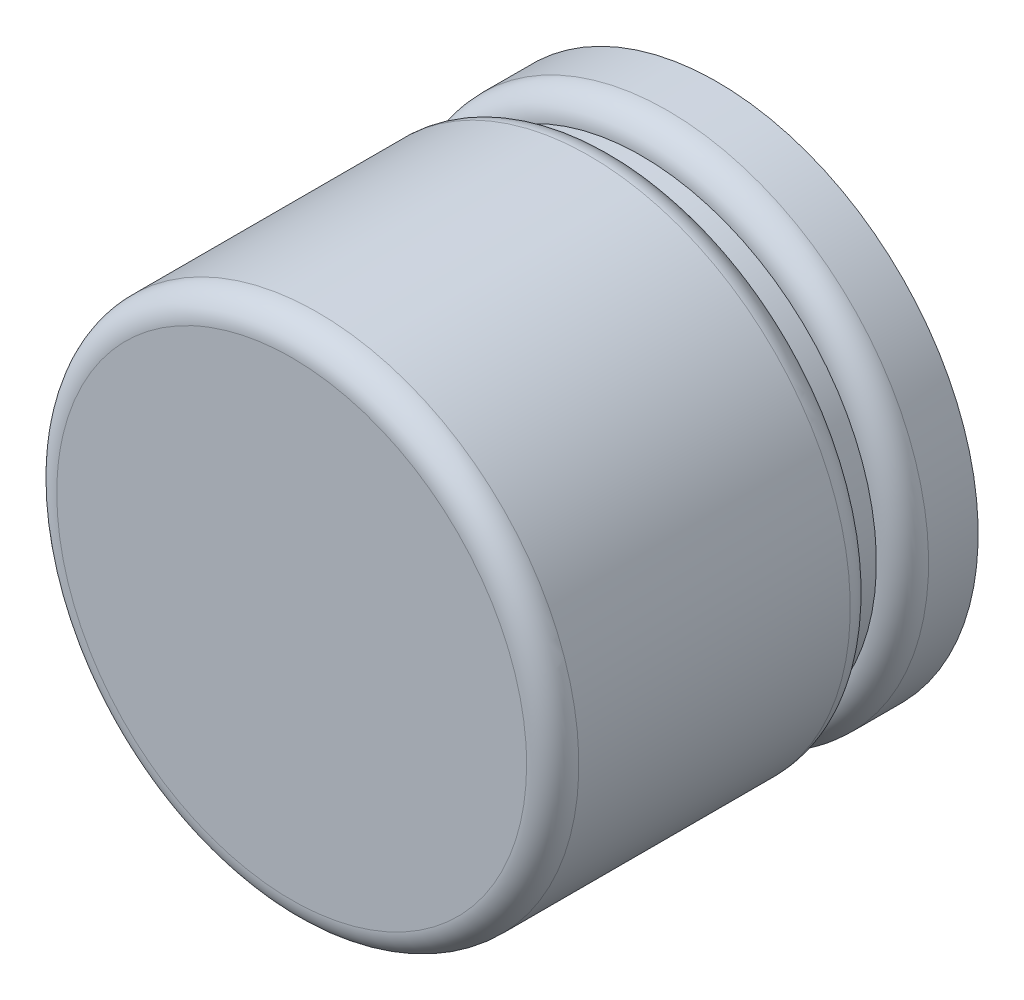
ISO-10303-21;
HEADER;
FILE_DESCRIPTION(('STEP AP214'),'2;1');
FILE_NAME('part.step','',(''),(''),'','','');
FILE_SCHEMA(('AUTOMOTIVE_DESIGN { 1 0 10303 214 1 1 1 1 }'));
ENDSEC;
DATA;
#1=APPLICATION_CONTEXT('core data for automotive mechanical design processes');
#2=APPLICATION_PROTOCOL_DEFINITION('international standard','automotive_design',2000,#1);
#3=PRODUCT_CONTEXT('',#1,'mechanical');
#4=PRODUCT('Part','Part','',(#3));
#5=PRODUCT_RELATED_PRODUCT_CATEGORY('part','',(#4));
#6=PRODUCT_DEFINITION_FORMATION('','',#4);
#7=PRODUCT_DEFINITION_CONTEXT('part definition',#1,'design');
#8=PRODUCT_DEFINITION('design','',#6,#7);
#9=PRODUCT_DEFINITION_SHAPE('','',#8);
#10=(LENGTH_UNIT() NAMED_UNIT(*) SI_UNIT(.MILLI.,.METRE.));
#11=(NAMED_UNIT(*) PLANE_ANGLE_UNIT() SI_UNIT($,.RADIAN.));
#12=(NAMED_UNIT(*) SI_UNIT($,.STERADIAN.) SOLID_ANGLE_UNIT());
#13=UNCERTAINTY_MEASURE_WITH_UNIT(LENGTH_MEASURE(1.E-05),#10,'distance_accuracy_value','');
#14=(GEOMETRIC_REPRESENTATION_CONTEXT(3) GLOBAL_UNCERTAINTY_ASSIGNED_CONTEXT((#13)) GLOBAL_UNIT_ASSIGNED_CONTEXT((#10,
#11,#12)) REPRESENTATION_CONTEXT('',''));
#15=CARTESIAN_POINT('',(0.,0.,0.));
#16=DIRECTION('',(0.,0.,1.));
#17=DIRECTION('',(1.,0.,0.));
#18=AXIS2_PLACEMENT_3D('',#15,#16,#17);
#19=CARTESIAN_POINT('',(-5.99999746,-5.99999746,0.639999985695));
#20=DIRECTION('',(0.,0.,1.));
#21=DIRECTION('',(1.,0.,0.));
#22=AXIS2_PLACEMENT_3D('',#19,#20,#21);
#23=PLANE('',#22);
#24=CARTESIAN_POINT('',(2.54000000055E-06,-1.84279794,0.639999985695));
#25=DIRECTION('',(0.,0.,-1.));
#26=DIRECTION('',(-1.,0.,0.));
#27=AXIS2_PLACEMENT_3D('',#24,#25,#26);
#28=CIRCLE('',#27,2.000000000188);
#29=CARTESIAN_POINT('',(-1.999997460188,-1.84279794,0.639999985695));
#30=VERTEX_POINT('',#29);
#31=EDGE_CURVE('E21',#30,#30,#28,.F.);
#32=ORIENTED_EDGE('',*,*,#31,.F.);
#33=EDGE_LOOP('',(#32));
#34=FACE_BOUND('',#33,.T.);
#35=ADVANCED_FACE('F16',(#34),#23,.F.);
#36=CARTESIAN_POINT('',(2.54000000055E-06,-1.84279794,1.01999996));
#37=DIRECTION('',(0.,0.,-1.));
#38=DIRECTION('',(-1.,0.,0.));
#39=AXIS2_PLACEMENT_3D('',#36,#37,#38);
#40=CYLINDRICAL_SURFACE('',#39,2.000000000188);
#41=ORIENTED_EDGE('',*,*,#31,.T.);
#42=EDGE_LOOP('',(#41));
#43=FACE_BOUND('',#42,.T.);
#44=CARTESIAN_POINT('',(2.54000000004216E-06,-1.84279794,1.01999996));
#45=DIRECTION('',(0.,0.,-1.));
#46=DIRECTION('',(0.,1.,0.));
#47=AXIS2_PLACEMENT_3D('',#44,#45,#46);
#48=CIRCLE('',#47,1.99999999965255);
#49=CARTESIAN_POINT('',(2.54000000004216E-06,0.157202059652549,1.01999996));
#50=VERTEX_POINT('',#49);
#51=EDGE_CURVE('E42',#50,#50,#48,.F.);
#52=ORIENTED_EDGE('',*,*,#51,.F.);
#53=EDGE_LOOP('',(#52));
#54=FACE_BOUND('',#53,.T.);
#55=ADVANCED_FACE('F62',(#43,#54),#40,.T.);
#56=CARTESIAN_POINT('',(2.54000000004216E-06,-1.84279794,1.01999996));
#57=DIRECTION('',(0.,0.,-1.));
#58=DIRECTION('',(0.,1.,0.));
#59=AXIS2_PLACEMENT_3D('',#56,#57,#58);
#60=TOROIDAL_SURFACE('',#59,1.79999999965258,0.199999999999965);
#61=ORIENTED_EDGE('',*,*,#51,.T.);
#62=EDGE_LOOP('',(#61));
#63=FACE_BOUND('',#62,.T.);
#64=CARTESIAN_POINT('',(2.54000000055E-06,-1.84279794,1.21999996));
#65=DIRECTION('',(0.,0.,-1.));
#66=DIRECTION('',(-1.,0.,0.));
#67=AXIS2_PLACEMENT_3D('',#64,#65,#66);
#68=CIRCLE('',#67,1.799999999653);
#69=CARTESIAN_POINT('',(-1.799997459653,-1.84279794,1.21999996));
#70=VERTEX_POINT('',#69);
#71=EDGE_CURVE('E40',#70,#70,#68,.F.);
#72=ORIENTED_EDGE('',*,*,#71,.F.);
#73=EDGE_LOOP('',(#72));
#74=FACE_BOUND('',#73,.T.);
#75=ADVANCED_FACE('F58',(#63,#74),#60,.T.);
#76=CARTESIAN_POINT('',(-2.42999768,0.6200013,3.89999982));
#77=DIRECTION('',(0.,0.,-1.));
#78=DIRECTION('',(-1.,0.,0.));
#79=AXIS2_PLACEMENT_3D('',#76,#77,#78);
#80=PLANE('',#79);
#81=CARTESIAN_POINT('',(2.54000000047584E-06,-1.84279794,3.89999982));
#82=DIRECTION('',(0.,0.,1.));
#83=DIRECTION('',(0.,-1.,0.));
#84=AXIS2_PLACEMENT_3D('',#81,#82,#83);
#85=CIRCLE('',#84,1.800000000188);
#86=CARTESIAN_POINT('',(1.800002540188,-1.84279794000053,3.89999982));
#87=VERTEX_POINT('',#86);
#88=CARTESIAN_POINT('',(-1.799997460188,-1.84279794,3.89999982));
#89=VERTEX_POINT('',#88);
#90=EDGE_CURVE('E33',#87,#89,#85,.F.);
#91=ORIENTED_EDGE('',*,*,#90,.F.);
#92=CARTESIAN_POINT('',(-1.799997460188,-1.84279794,3.89999982));
#93=CARTESIAN_POINT('',(-1.79997846593751,-1.80875734593953,3.89999981940235));
#94=CARTESIAN_POINT('',(-1.79899587415719,-1.7747170785684,3.89999981693248));
#95=CARTESIAN_POINT('',(-1.79511162104202,-1.7067468437002,3.89999981175483));
#96=CARTESIAN_POINT('',(-1.79220999625375,-1.67281687411495,3.89999980904705));
#97=CARTESIAN_POINT('',(-1.78449581926608,-1.60517573413569,3.89999980689983));
#98=CARTESIAN_POINT('',(-1.77968327597388,-1.57146456272254,3.89999980746038));
#99=CARTESIAN_POINT('',(-1.76816212959825,-1.50436454226304,3.89999981116872));
#100=CARTESIAN_POINT('',(-1.76145350808213,-1.47097569635344,3.89999981431654));
#101=CARTESIAN_POINT('',(-1.75162457469155,-1.42833031011706,3.89999981754525));
#102=CARTESIAN_POINT('',(-1.74936371867678,-1.41887062259552,3.89999981821083));
#103=CARTESIAN_POINT('',(-1.74468983051405,-1.39998888747317,3.89999981928339));
#104=CARTESIAN_POINT('',(-1.74227679713952,-1.39056684017637,3.89999981969038));
#105=CARTESIAN_POINT('',(-1.73163618299771,-1.35037696672477,3.89999982048316));
#106=CARTESIAN_POINT('',(-1.7226665048486,-1.31980014961696,3.89999981871546));
#107=CARTESIAN_POINT('',(-1.70800531024628,-1.27432986227567,3.89999981301106));
#108=CARTESIAN_POINT('',(-1.70291681873642,-1.25923810189805,3.89999981060057));
#109=CARTESIAN_POINT('',(-1.69234073914227,-1.2291943193367,3.89999980486516));
#110=CARTESIAN_POINT('',(-1.68685314540695,-1.21424229913498,3.89999980154023));
#111=CARTESIAN_POINT('',(-1.67320860900115,-1.1785383510827,3.89999979257076));
#112=CARTESIAN_POINT('',(-1.66486191334706,-1.15785868168089,3.89999978653036));
#113=CARTESIAN_POINT('',(-1.64740553079934,-1.11682376140855,3.89999977307723));
#114=CARTESIAN_POINT('',(-1.63829582986289,-1.09646851651712,3.89999976566447));
#115=CARTESIAN_POINT('',(-1.61932588412417,-1.05611030145393,3.8999997496977));
#116=CARTESIAN_POINT('',(-1.60946562612914,-1.03610733748191,3.89999974114365));
#117=CARTESIAN_POINT('',(-1.58900820901917,-0.996481444323148,3.89999972311489));
#118=CARTESIAN_POINT('',(-1.5784110375609,-0.976858521509151,3.89999971364016));
#119=CARTESIAN_POINT('',(-1.55649442043757,-0.938019846794878,3.89999969397907));
#120=CARTESIAN_POINT('',(-1.54517496327164,-0.918804101384535,3.89999968379271));
#121=CARTESIAN_POINT('',(-1.52182939389261,-0.880806358956951,3.89999966290744));
#122=CARTESIAN_POINT('',(-1.50980327101183,-0.862024368493551,3.89999965220853));
#123=CARTESIAN_POINT('',(-1.48506103905012,-0.824920195526461,3.89999963048215));
#124=CARTESIAN_POINT('',(-1.47234492012381,-0.806598019589217,3.89999961945468));
#125=CARTESIAN_POINT('',(-1.44624004696306,-0.770438567820351,3.89999959725891));
#126=CARTESIAN_POINT('',(-1.43285128368707,-0.752601298511721,3.8999995860906));
#127=CARTESIAN_POINT('',(-1.40933888867603,-0.722460449608983,3.89999956692807));
#128=CARTESIAN_POINT('',(-1.39937520001804,-0.710031789330433,3.89999955893858));
#129=CARTESIAN_POINT('',(-1.37912150255018,-0.685443646523599,3.89999954310203));
#130=CARTESIAN_POINT('',(-1.36883149093758,-0.673284166308774,3.89999953525498));
#131=CARTESIAN_POINT('',(-1.33748195140313,-0.637221326669943,3.89999951144714));
#132=CARTESIAN_POINT('',(-1.31594142542325,-0.613731654041129,3.89999949521849));
#133=CARTESIAN_POINT('',(-1.28320299338657,-0.579882835836692,3.8999994743821));
#134=CARTESIAN_POINT('',(-1.2724723106977,-0.569066947045425,3.89999946812881));
#135=CARTESIAN_POINT('',(-1.25073851477805,-0.547712025056013,3.89999945875229));
#136=CARTESIAN_POINT('',(-1.23973540147814,-0.537172991928113,3.89999945562904));
#137=CARTESIAN_POINT('',(-1.20911268044773,-0.508581083378854,3.89999945084904));
#138=CARTESIAN_POINT('',(-1.18921912910941,-0.4908201658773,3.89999945204831));
#139=CARTESIAN_POINT('',(-1.14866076300758,-0.456203622610199,3.89999946313505));
#140=CARTESIAN_POINT('',(-1.1279959570625,-0.439347986499158,3.89999947302243));
#141=CARTESIAN_POINT('',(-1.08593575863746,-0.40657494266664,3.89999950032798));
#142=CARTESIAN_POINT('',(-1.06454038003681,-0.390657517136833,3.89999951774602));
#143=CARTESIAN_POINT('',(-1.02106162472674,-0.359792651888722,3.89999955814623));
#144=CARTESIAN_POINT('',(-0.998978266294918,-0.344845186433921,3.89999958112824));
#145=CARTESIAN_POINT('',(-0.957369003517289,-0.318014148112455,3.89999962622576));
#146=CARTESIAN_POINT('',(-0.937928459434872,-0.305997936289878,3.89999964799598));
#147=CARTESIAN_POINT('',(-0.898602768274954,-0.282717689796488,3.89999969108329));
#148=CARTESIAN_POINT('',(-0.878717636685792,-0.271453628976912,3.8999997124004));
#149=CARTESIAN_POINT('',(-0.838532672646908,-0.249693474693614,3.89999975155953));
#150=CARTESIAN_POINT('',(-0.818232856957231,-0.2391973502709,3.89999976940169));
#151=CARTESIAN_POINT('',(-0.777246443441831,-0.218991449814853,3.89999979869767));
#152=CARTESIAN_POINT('',(-0.756559863408541,-0.209281637717591,3.89999981015179));
#153=CARTESIAN_POINT('',(-0.719138852450963,-0.19257184820692,3.89999981984566));
#154=CARTESIAN_POINT('',(-0.702469284715718,-0.185426015453091,3.89999982032364));
#155=CARTESIAN_POINT('',(-0.66450010818888,-0.169815123357912,3.89999981922713));
#156=CARTESIAN_POINT('',(-0.643138960446225,-0.161499229714553,3.89999981707802));
#157=CARTESIAN_POINT('',(-0.595626227989485,-0.144034897639392,3.89999981260328));
#158=CARTESIAN_POINT('',(-0.569405247085684,-0.135074891435718,3.8999998103344));
#159=CARTESIAN_POINT('',(-0.512017898451042,-0.116927921096764,3.89999980677149));
#160=CARTESIAN_POINT('',(-0.480779293022231,-0.107968844192648,3.8999998057134));
#161=CARTESIAN_POINT('',(-0.417994700622,-0.0917845875213735,3.89999980518205));
#162=CARTESIAN_POINT('',(-0.386450554390878,-0.0845522872417161,3.89999980570215));
#163=CARTESIAN_POINT('',(-0.337533239326891,-0.0747141532107915,3.89999980722486));
#164=CARTESIAN_POINT('',(-0.320279133379974,-0.0715054628620235,3.89999980789786));
#165=CARTESIAN_POINT('',(-0.284781432655249,-0.0654389579706539,3.8999998094501));
#166=CARTESIAN_POINT('',(-0.266533185958827,-0.0626081894002398,3.89999981033826));
#167=CARTESIAN_POINT('',(-0.229051420100459,-0.0573823867457498,3.89999981221837));
#168=CARTESIAN_POINT('',(-0.209813920629058,-0.0550159254121061,3.89999981321328));
#169=CARTESIAN_POINT('',(-0.170361878558818,-0.0508077159769987,3.89999981517092));
#170=CARTESIAN_POINT('',(-0.15014412186274,-0.0489960458691738,3.8999998161299));
#171=CARTESIAN_POINT('',(-0.10874545991109,-0.0459906151507691,3.89999981784599));
#172=CARTESIAN_POINT('',(-0.0875622588709934,-0.0448284245447274,3.89999981859203));
#173=CARTESIAN_POINT('',(-0.0442527605364783,-0.0432187780837078,3.89999981967839));
#174=CARTESIAN_POINT('',(-0.0221252328947104,-0.0428043479062116,3.89999981999979));
#175=CARTESIAN_POINT('',(0.0235645374911004,-0.0427911163735539,3.89999982000023));
#176=CARTESIAN_POINT('',(0.0471268130579259,-0.0432469215257228,3.89999981963628));
#177=CARTESIAN_POINT('',(0.0942154633238307,-0.0450837143169699,3.89999981828752));
#178=CARTESIAN_POINT('',(0.117741837624191,-0.0464647121573353,3.89999981730269));
#179=CARTESIAN_POINT('',(0.164722463601538,-0.0501496103681579,3.89999981481293));
#180=CARTESIAN_POINT('',(0.188176714522574,-0.0524535203789716,3.89999981330798));
#181=CARTESIAN_POINT('',(0.234976860925149,-0.0579807508896076,3.89999980987357));
#182=CARTESIAN_POINT('',(0.258322755335432,-0.0612040804595835,3.89999980794411));
#183=CARTESIAN_POINT('',(0.304870155142679,-0.0685651803650829,3.89999980375077));
#184=CARTESIAN_POINT('',(0.328071659196976,-0.0727029591909263,3.89999980148688));
#185=CARTESIAN_POINT('',(0.374294458330978,-0.0818865904632503,3.8999997967093));
#186=CARTESIAN_POINT('',(0.397315751840272,-0.0869324508138551,3.89999979419561));
#187=CARTESIAN_POINT('',(0.443142589994912,-0.0979244709309108,3.89999978899761));
#188=CARTESIAN_POINT('',(0.46594813288594,-0.10387063801128,3.89999978631329));
#189=CARTESIAN_POINT('',(0.511308261967966,-0.116654107530075,3.89999978084775));
#190=CARTESIAN_POINT('',(0.533862846264478,-0.12349141669078,3.89999977806652));
#191=CARTESIAN_POINT('',(0.578686237606825,-0.138046629206943,3.89999977247539));
#192=CARTESIAN_POINT('',(0.600955042661548,-0.145764538694111,3.89999976966549));
#193=CARTESIAN_POINT('',(0.64517249588049,-0.162069050243828,3.89999976407982));
#194=CARTESIAN_POINT('',(0.667121142000179,-0.170655657851091,3.89999976130405));
#195=CARTESIAN_POINT('',(0.710664391834296,-0.188684321845495,3.89999975584396));
#196=CARTESIAN_POINT('',(0.732258993493526,-0.198126383196398,3.89999975315965));
#197=CARTESIAN_POINT('',(0.775060815395131,-0.217851389190348,3.89999974793434));
#198=CARTESIAN_POINT('',(0.7962680336138,-0.22813433822469,3.89999974539336));
#199=CARTESIAN_POINT('',(0.838262347678486,-0.249525254900495,3.89999974050112));
#200=CARTESIAN_POINT('',(0.859049441573738,-0.26063322637167,3.89999973814987));
#201=CARTESIAN_POINT('',(0.900171414714343,-0.283657048553207,3.89999973367806));
#202=CARTESIAN_POINT('',(0.920506292122483,-0.295572902544943,3.8999997315575));
#203=CARTESIAN_POINT('',(0.960692438311227,-0.320194102201059,3.89999972758255));
#204=CARTESIAN_POINT('',(0.980543705407828,-0.332899450614026,3.89999972572817));
#205=CARTESIAN_POINT('',(1.01973198383625,-0.359080031763802,3.89999972231562));
#206=CARTESIAN_POINT('',(1.03906899367585,-0.372555266734218,3.89999972075745));
#207=CARTESIAN_POINT('',(1.07719890467922,-0.400254824171405,3.89999971796188));
#208=CARTESIAN_POINT('',(1.09599180457995,-0.414479148376798,3.89999971672449));
#209=CARTESIAN_POINT('',(1.13300448317802,-0.443654930121904,3.8999997145896));
#210=CARTESIAN_POINT('',(1.1512242608776,-0.458606388927373,3.89999971369209));
#211=CARTESIAN_POINT('',(1.18706256778669,-0.4892133623109,3.89999971225063));
#212=CARTESIAN_POINT('',(1.20468109629842,-0.504868877706022,3.89999971170667));
#213=CARTESIAN_POINT('',(1.23928970627405,-0.536859798980515,3.89999971098048));
#214=CARTESIAN_POINT('',(1.25627978737329,-0.5531952052544,3.89999971079825));
#215=CARTESIAN_POINT('',(1.28960527474641,-0.586520692627533,3.89999971079825));
#216=CARTESIAN_POINT('',(1.30594068102028,-0.603510773726782,3.89999971098048));
#217=CARTESIAN_POINT('',(1.33793160229476,-0.638119383702436,3.89999971170667));
#218=CARTESIAN_POINT('',(1.35358711768987,-0.655737912214168,3.89999971225063));
#219=CARTESIAN_POINT('',(1.38419409107337,-0.691576219123283,3.89999971369209));
#220=CARTESIAN_POINT('',(1.39914554987883,-0.70979599682287,3.8999997145896));
#221=CARTESIAN_POINT('',(1.42832133162392,-0.746808675420951,3.89999971672449));
#222=CARTESIAN_POINT('',(1.4425456558293,-0.765601575321693,3.89999971796188));
#223=CARTESIAN_POINT('',(1.47024521326646,-0.803731486325075,3.89999972075745));
#224=CARTESIAN_POINT('',(1.48372044823687,-0.823068496164688,3.89999972231562));
#225=CARTESIAN_POINT('',(1.50990102938662,-0.86225677459312,3.89999972572817));
#226=CARTESIAN_POINT('',(1.52260637779958,-0.882108041689727,3.89999972758255));
#227=CARTESIAN_POINT('',(1.54722757745567,-0.922294187878486,3.8999997315575));
#228=CARTESIAN_POINT('',(1.55914343144738,-0.942629065286635,3.89999973367806));
#229=CARTESIAN_POINT('',(1.58216725362892,-0.983751038427244,3.89999973814987));
#230=CARTESIAN_POINT('',(1.59327522510012,-1.00453813232249,3.89999974050112));
#231=CARTESIAN_POINT('',(1.6146661417758,-1.04653244638721,3.89999974539336));
#232=CARTESIAN_POINT('',(1.62494909080997,-1.06773966460592,3.89999974793434));
#233=CARTESIAN_POINT('',(1.64467409680431,-1.11054148650744,3.89999975315965));
#234=CARTESIAN_POINT('',(1.65411615815576,-1.13213608816655,3.89999975584396));
#235=CARTESIAN_POINT('',(1.67214482214861,-1.17567933800102,3.89999976130405));
#236=CARTESIAN_POINT('',(1.68073142975378,-1.1976279841212,3.89999976407982));
#237=CARTESIAN_POINT('',(1.69703594130916,-1.24184543733884,3.89999976966549));
#238=CARTESIAN_POINT('',(1.70475385080408,-1.26411424239178,3.89999977247539));
#239=CARTESIAN_POINT('',(1.71930906329899,-1.30893763373901,3.89999977806652));
#240=CARTESIAN_POINT('',(1.72614637243068,-1.33149221804218,3.89999978084775));
#241=CARTESIAN_POINT('',(1.73892984202868,-1.37685234710601,3.89999978631329));
#242=CARTESIAN_POINT('',(1.74487600921727,-1.39965788997218,3.89999978899761));
#243=CARTESIAN_POINT('',(1.75586802903861,-1.44548472819475,3.89999979419561));
#244=CARTESIAN_POINT('',(1.76091388898528,-1.46850602179685,3.8999997967093));
#245=CARTESIAN_POINT('',(1.77009752136109,-1.51472882067732,3.89999980148688));
#246=CARTESIAN_POINT('',(1.77423530169434,-1.53793032438529,3.89999980375076));
#247=CARTESIAN_POINT('',(1.78159639748149,-1.58447772513872,3.89999980794412));
#248=CARTESIAN_POINT('',(1.78481972142578,-1.60782362084149,3.8999998098736));
#249=CARTESIAN_POINT('',(1.79034696730596,-1.65462376371293,3.89999981330795));
#250=CARTESIAN_POINT('',(1.79265089831175,-1.67807800981039,3.89999981481284));
#251=CARTESIAN_POINT('',(1.79633573916336,-1.72505864896593,3.89999981730278));
#252=CARTESIAN_POINT('',(1.79771665865058,-1.74858504126783,3.89999981828784));
#253=CARTESIAN_POINT('',(1.79955366550578,-1.79567364235279,3.89999981963595));
#254=CARTESIAN_POINT('',(1.80000976307097,-1.81923585073808,3.89999981999902));
#255=CARTESIAN_POINT('',(1.800002540188,-1.8427979400008,3.89999982));
#256=B_SPLINE_CURVE_WITH_KNOTS('',3,(#92,#93,#94,#95,#96,#97,#98,#99,#100,#101,#102,#103,#104,
#105,#106,#107,#108,#109,#110,#111,#112,#113,#114,#115,#116,#117,#118,#119,#120,#121,#122,#123,
#124,#125,#126,#127,#128,#129,#130,#131,#132,#133,#134,#135,#136,#137,#138,#139,#140,#141,#142,
#143,#144,#145,#146,#147,#148,#149,#150,#151,#152,#153,#154,#155,#156,#157,#158,#159,#160,#161,
#162,#163,#164,#165,#166,#167,#168,#169,#170,#171,#172,#173,#174,#175,#176,#177,#178,#179,#180,
#181,#182,#183,#184,#185,#186,#187,#188,#189,#190,#191,#192,#193,#194,#195,#196,#197,#198,#199,
#200,#201,#202,#203,#204,#205,#206,#207,#208,#209,#210,#211,#212,#213,#214,#215,#216,#217,#218,
#219,#220,#221,#222,#223,#224,#225,#226,#227,#228,#229,#230,#231,#232,#233,#234,#235,#236,#237,
#238,#239,#240,#241,#242,#243,#244,#245,#246,#247,#248,#249,#250,#251,#252,#253,#254,#255),
.UNSPECIFIED.,.F.,.F.,(4,2,2,2,2,2,2,2,2,2,2,2,2,2,2,2,2,2,2,2,2,2,2,2,2,2,2,2,2,2,2,2,2,2,2,2,
2,2,2,2,2,2,2,2,2,2,2,2,2,2,2,2,2,2,2,2,2,2,2,2,2,2,2,2,2,2,2,2,2,2,2,2,2,2,2,2,2,2,2,2,2,4),
(0.,0.102108744251562,0.204215543973069,0.306321867758237,0.408429184202286,0.437606652886023,
0.466784356771643,0.562324622070954,0.610100021854425,0.657876098239361,0.724761816408849,
0.791648765854524,0.858536891263001,0.925426137320766,0.992316448714178,1.05920777012948,
1.12610004625279,1.19299322177011,1.24077592952733,1.2885590477923,1.38411800958503,
1.42982178136691,1.47552556474459,1.55550241064237,1.63547834237561,1.7154527555834,
1.79542504591673,1.86397208261325,1.93251673500873,2.00105862253464,2.06959736462914,
2.12399989808053,2.19275151168395,2.27585106172156,2.37329750128914,2.47033489008057,
2.52297834661613,2.57836880038025,2.63650632506569,2.69739100476705,2.76102293398253,
2.82740221761526,2.89808391350139,2.96876638874535,3.0394496023283,3.11013351323139,
3.18081808043578,3.25150326292262,3.32218901967306,3.39287530966826,3.46356209188937,
3.53424932531755,3.60493696893396,3.67562498171976,3.74631332265613,3.81700195072422,
3.88769082490522,3.9583799041803,4.02906914753065,4.09975851393744,4.17044796238186,
4.24113745184509,4.31182694130832,4.38251638975274,4.45320575615953,4.52389499950987,
4.59458407878495,4.66527295296595,4.73596158103404,4.8066499219704,4.8773379347562,
4.94802557837261,5.01871281180079,5.08939959402189,5.16008588401709,5.23077164076753,
5.30145682325436,5.37214139045874,5.44282530136183,5.51350851494477,5.58419099018872,
5.65487268607485),.UNSPECIFIED.);
#257=EDGE_CURVE('E35',#89,#87,#256,.T.);
#258=ORIENTED_EDGE('',*,*,#257,.F.);
#259=EDGE_LOOP('',(#91,#258));
#260=FACE_BOUND('',#259,.T.);
#261=ADVANCED_FACE('F36',(#260),#80,.F.);
#262=CARTESIAN_POINT('',(2.54000000055E-06,-1.84279794,1.41999996));
#263=DIRECTION('',(0.,0.,-1.));
#264=DIRECTION('',(-1.,0.,0.));
#265=AXIS2_PLACEMENT_3D('',#262,#263,#264);
#266=CYLINDRICAL_SURFACE('',#265,1.799999999653);
#267=CARTESIAN_POINT('',(2.54000000004736E-06,-1.84279794,1.41999995999886));
#268=DIRECTION('',(0.,0.,-1.));
#269=DIRECTION('',(0.,1.,0.));
#270=AXIS2_PLACEMENT_3D('',#267,#268,#269);
#271=CIRCLE('',#270,1.79999999965258);
#272=CARTESIAN_POINT('',(2.54000000004736E-06,-0.0427979403474154,1.41999995999886));
#273=VERTEX_POINT('',#272);
#274=EDGE_CURVE('E38',#273,#273,#271,.F.);
#275=ORIENTED_EDGE('',*,*,#274,.F.);
#276=EDGE_LOOP('',(#275));
#277=FACE_BOUND('',#276,.T.);
#278=ORIENTED_EDGE('',*,*,#71,.T.);
#279=EDGE_LOOP('',(#278));
#280=FACE_BOUND('',#279,.T.);
#281=ADVANCED_FACE('F85',(#277,#280),#266,.T.);
#282=CARTESIAN_POINT('',(2.54000000047584E-06,-1.84279794000025,3.69999982));
#283=DIRECTION('',(0.,0.,1.));
#284=DIRECTION('',(0.,-1.,0.));
#285=AXIS2_PLACEMENT_3D('',#282,#283,#284);
#286=TOROIDAL_SURFACE('',#285,1.800000000188,0.2);
#287=CARTESIAN_POINT('',(2.54000000055E-06,-1.84279794,3.69999982));
#288=DIRECTION('',(0.,0.,-1.));
#289=DIRECTION('',(-1.,0.,0.));
#290=AXIS2_PLACEMENT_3D('',#287,#288,#289);
#291=CIRCLE('',#290,2.000000000188);
#292=CARTESIAN_POINT('',(-1.999997460188,-1.84279794,3.69999982));
#293=VERTEX_POINT('',#292);
#294=EDGE_CURVE('E27',#293,#293,#291,.T.);
#295=ORIENTED_EDGE('',*,*,#294,.F.);
#296=EDGE_LOOP('',(#295));
#297=FACE_BOUND('',#296,.T.);
#298=ORIENTED_EDGE('',*,*,#257,.T.);
#299=ORIENTED_EDGE('',*,*,#90,.T.);
#300=EDGE_LOOP('',(#298,#299));
#301=FACE_BOUND('',#300,.T.);
#302=ADVANCED_FACE('F18',(#297,#301),#286,.T.);
#303=CARTESIAN_POINT('',(2.54000000004216E-06,-1.84279794,1.61999996));
#304=DIRECTION('',(0.,0.,-1.));
#305=DIRECTION('',(0.,1.,0.));
#306=AXIS2_PLACEMENT_3D('',#303,#304,#305);
#307=TOROIDAL_SURFACE('',#306,1.79999999965258,0.200000000001143);
#308=CARTESIAN_POINT('',(2.54000000055E-06,-1.84279794,1.61999996));
#309=DIRECTION('',(0.,0.,-1.));
#310=DIRECTION('',(-1.,0.,0.));
#311=AXIS2_PLACEMENT_3D('',#308,#309,#310);
#312=CIRCLE('',#311,2.000000000188);
#313=CARTESIAN_POINT('',(-1.999997460188,-1.84279794,1.61999996));
#314=VERTEX_POINT('',#313);
#315=EDGE_CURVE('E11',#314,#314,#312,.F.);
#316=ORIENTED_EDGE('',*,*,#315,.F.);
#317=EDGE_LOOP('',(#316));
#318=FACE_BOUND('',#317,.T.);
#319=ORIENTED_EDGE('',*,*,#274,.T.);
#320=EDGE_LOOP('',(#319));
#321=FACE_BOUND('',#320,.T.);
#322=ADVANCED_FACE('F75',(#318,#321),#307,.T.);
#323=CARTESIAN_POINT('',(2.54000000055E-06,-1.84279794,5.21999996));
#324=DIRECTION('',(0.,0.,-1.));
#325=DIRECTION('',(-1.,0.,0.));
#326=AXIS2_PLACEMENT_3D('',#323,#324,#325);
#327=CYLINDRICAL_SURFACE('',#326,2.000000000188);
#328=ORIENTED_EDGE('',*,*,#315,.T.);
#329=EDGE_LOOP('',(#328));
#330=FACE_BOUND('',#329,.T.);
#331=ORIENTED_EDGE('',*,*,#294,.T.);
#332=EDGE_LOOP('',(#331));
#333=FACE_BOUND('',#332,.T.);
#334=ADVANCED_FACE('F73',(#330,#333),#327,.T.);
#335=CLOSED_SHELL('',(#35,#55,#75,#261,#281,#302,#322,#334));
#336=MANIFOLD_SOLID_BREP('B1',#335);
#337=ADVANCED_BREP_SHAPE_REPRESENTATION('',(#18,#336),#14);
#338=SHAPE_DEFINITION_REPRESENTATION(#9,#337);
ENDSEC;
END-ISO-10303-21;
